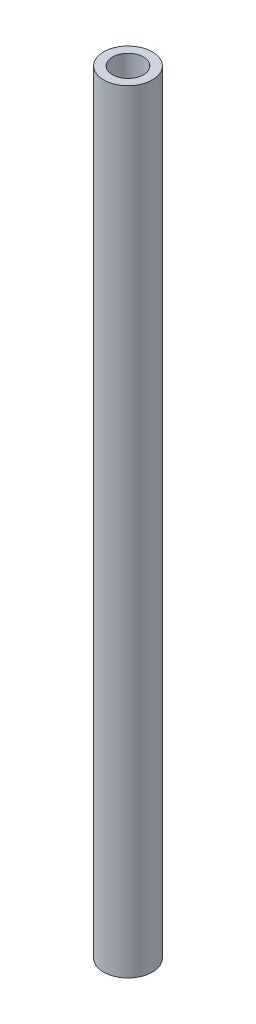
ISO-10303-21;
HEADER;
FILE_DESCRIPTION(('STEP AP214'),'2;1');
FILE_NAME('part.step','',(''),(''),'','','');
FILE_SCHEMA(('AUTOMOTIVE_DESIGN { 1 0 10303 214 1 1 1 1 }'));
ENDSEC;
DATA;
#1=APPLICATION_CONTEXT('core data for automotive mechanical design processes');
#2=APPLICATION_PROTOCOL_DEFINITION('international standard','automotive_design',2000,#1);
#3=PRODUCT_CONTEXT('',#1,'mechanical');
#4=PRODUCT('Part','Part','',(#3));
#5=PRODUCT_RELATED_PRODUCT_CATEGORY('part','',(#4));
#6=PRODUCT_DEFINITION_FORMATION('','',#4);
#7=PRODUCT_DEFINITION_CONTEXT('part definition',#1,'design');
#8=PRODUCT_DEFINITION('design','',#6,#7);
#9=PRODUCT_DEFINITION_SHAPE('','',#8);
#10=(LENGTH_UNIT() NAMED_UNIT(*) SI_UNIT(.MILLI.,.METRE.));
#11=(NAMED_UNIT(*) PLANE_ANGLE_UNIT() SI_UNIT($,.RADIAN.));
#12=(NAMED_UNIT(*) SI_UNIT($,.STERADIAN.) SOLID_ANGLE_UNIT());
#13=UNCERTAINTY_MEASURE_WITH_UNIT(LENGTH_MEASURE(1.E-05),#10,'distance_accuracy_value','');
#14=(GEOMETRIC_REPRESENTATION_CONTEXT(3) GLOBAL_UNCERTAINTY_ASSIGNED_CONTEXT((#13)) GLOBAL_UNIT_ASSIGNED_CONTEXT((#10,
#11,#12)) REPRESENTATION_CONTEXT('',''));
#15=CARTESIAN_POINT('',(0.,0.,0.));
#16=DIRECTION('',(0.,0.,1.));
#17=DIRECTION('',(1.,0.,0.));
#18=AXIS2_PLACEMENT_3D('',#15,#16,#17);
#19=CARTESIAN_POINT('',(0.,100.,0.));
#20=DIRECTION('',(0.,1.,0.));
#21=DIRECTION('',(0.,0.,1.));
#22=AXIS2_PLACEMENT_3D('',#19,#20,#21);
#23=PLANE('',#22);
#24=CARTESIAN_POINT('',(0.,100.,0.));
#25=DIRECTION('',(0.,1.,0.));
#26=DIRECTION('',(0.,0.,1.));
#27=AXIS2_PLACEMENT_3D('',#24,#25,#26);
#28=CIRCLE('',#27,3.15);
#29=CARTESIAN_POINT('',(0.,100.,3.15));
#30=VERTEX_POINT('',#29);
#31=EDGE_CURVE('E10',#30,#30,#28,.T.);
#32=ORIENTED_EDGE('',*,*,#31,.T.);
#33=EDGE_LOOP('',(#32));
#34=FACE_BOUND('',#33,.T.);
#35=CARTESIAN_POINT('',(0.,100.,0.));
#36=DIRECTION('',(0.,1.,0.));
#37=DIRECTION('',(0.,0.,1.));
#38=AXIS2_PLACEMENT_3D('',#35,#36,#37);
#39=CIRCLE('',#38,2.);
#40=CARTESIAN_POINT('',(0.,100.,2.));
#41=VERTEX_POINT('',#40);
#42=EDGE_CURVE('E50',#41,#41,#39,.T.);
#43=ORIENTED_EDGE('',*,*,#42,.F.);
#44=EDGE_LOOP('',(#43));
#45=FACE_BOUND('',#44,.T.);
#46=ADVANCED_FACE('F37',(#34,#45),#23,.T.);
#47=CARTESIAN_POINT('',(0.,0.,0.));
#48=DIRECTION('',(0.,1.,0.));
#49=DIRECTION('',(0.,0.,1.));
#50=AXIS2_PLACEMENT_3D('',#47,#48,#49);
#51=PLANE('',#50);
#52=CARTESIAN_POINT('',(0.,0.,0.));
#53=DIRECTION('',(0.,1.,0.));
#54=DIRECTION('',(0.,0.,1.));
#55=AXIS2_PLACEMENT_3D('',#52,#53,#54);
#56=CIRCLE('',#55,3.15);
#57=CARTESIAN_POINT('',(0.,0.,3.15));
#58=VERTEX_POINT('',#57);
#59=EDGE_CURVE('E41',#58,#58,#56,.T.);
#60=ORIENTED_EDGE('',*,*,#59,.F.);
#61=EDGE_LOOP('',(#60));
#62=FACE_BOUND('',#61,.T.);
#63=CARTESIAN_POINT('',(0.,0.,0.));
#64=DIRECTION('',(0.,1.,0.));
#65=DIRECTION('',(0.,0.,1.));
#66=AXIS2_PLACEMENT_3D('',#63,#64,#65);
#67=CIRCLE('',#66,2.);
#68=CARTESIAN_POINT('',(0.,0.,2.));
#69=VERTEX_POINT('',#68);
#70=EDGE_CURVE('E52',#69,#69,#67,.T.);
#71=ORIENTED_EDGE('',*,*,#70,.T.);
#72=EDGE_LOOP('',(#71));
#73=FACE_BOUND('',#72,.T.);
#74=ADVANCED_FACE('F64',(#62,#73),#51,.F.);
#75=CARTESIAN_POINT('',(0.,100.,0.));
#76=DIRECTION('',(0.,-1.,0.));
#77=DIRECTION('',(0.,0.,-1.));
#78=AXIS2_PLACEMENT_3D('',#75,#76,#77);
#79=CYLINDRICAL_SURFACE('',#78,3.15);
#80=ORIENTED_EDGE('',*,*,#31,.F.);
#81=EDGE_LOOP('',(#80));
#82=FACE_BOUND('',#81,.T.);
#83=ORIENTED_EDGE('',*,*,#59,.T.);
#84=EDGE_LOOP('',(#83));
#85=FACE_BOUND('',#84,.T.);
#86=ADVANCED_FACE('F39',(#82,#85),#79,.T.);
#87=CARTESIAN_POINT('',(0.,100.,0.));
#88=DIRECTION('',(0.,-1.,0.));
#89=DIRECTION('',(0.,0.,-1.));
#90=AXIS2_PLACEMENT_3D('',#87,#88,#89);
#91=CYLINDRICAL_SURFACE('',#90,2.);
#92=ORIENTED_EDGE('',*,*,#42,.T.);
#93=EDGE_LOOP('',(#92));
#94=FACE_BOUND('',#93,.T.);
#95=ORIENTED_EDGE('',*,*,#70,.F.);
#96=EDGE_LOOP('',(#95));
#97=FACE_BOUND('',#96,.T.);
#98=ADVANCED_FACE('F60',(#94,#97),#91,.F.);
#99=CLOSED_SHELL('',(#46,#74,#86,#98));
#100=MANIFOLD_SOLID_BREP('B2',#99);
#101=ADVANCED_BREP_SHAPE_REPRESENTATION('',(#18,#100),#14);
#102=SHAPE_DEFINITION_REPRESENTATION(#9,#101);
ENDSEC;
END-ISO-10303-21;
